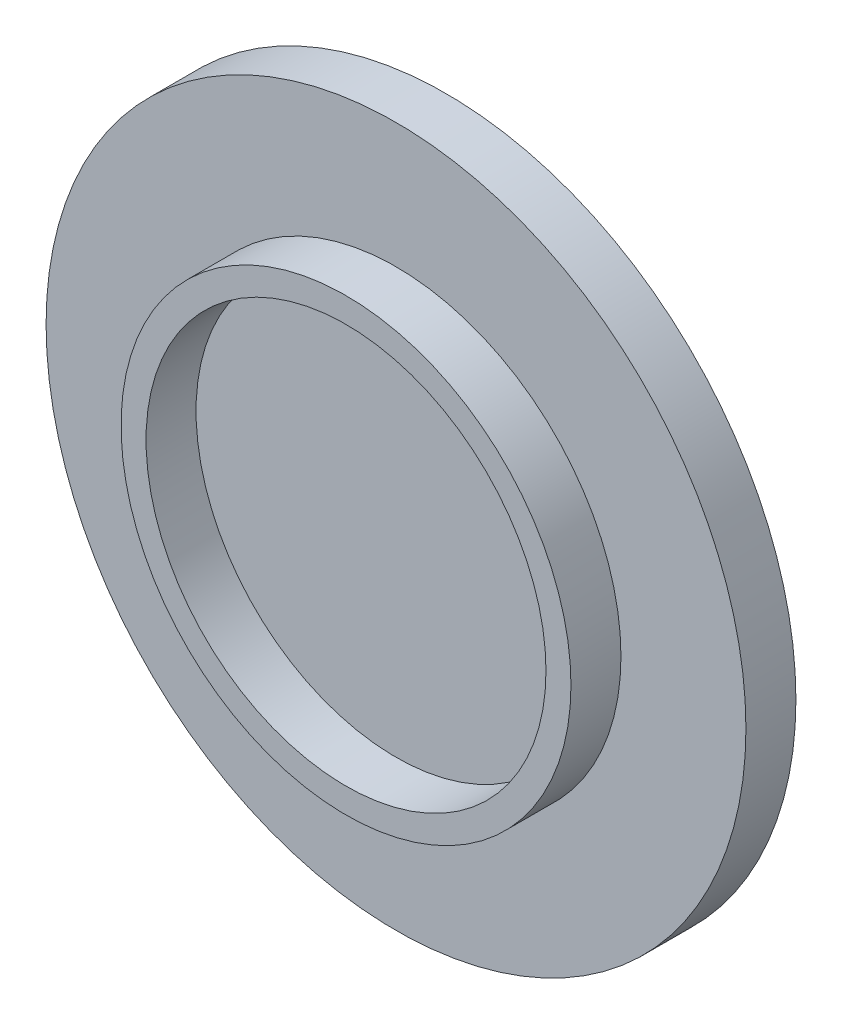
ISO-10303-21;
HEADER;
FILE_DESCRIPTION(('STEP AP214'),'2;1');
FILE_NAME('part.step','',(''),(''),'','','');
FILE_SCHEMA(('AUTOMOTIVE_DESIGN { 1 0 10303 214 1 1 1 1 }'));
ENDSEC;
DATA;
#1=APPLICATION_CONTEXT('core data for automotive mechanical design processes');
#2=APPLICATION_PROTOCOL_DEFINITION('international standard','automotive_design',2000,#1);
#3=PRODUCT_CONTEXT('',#1,'mechanical');
#4=PRODUCT('Part','Part','',(#3));
#5=PRODUCT_RELATED_PRODUCT_CATEGORY('part','',(#4));
#6=PRODUCT_DEFINITION_FORMATION('','',#4);
#7=PRODUCT_DEFINITION_CONTEXT('part definition',#1,'design');
#8=PRODUCT_DEFINITION('design','',#6,#7);
#9=PRODUCT_DEFINITION_SHAPE('','',#8);
#10=(LENGTH_UNIT() NAMED_UNIT(*) SI_UNIT(.MILLI.,.METRE.));
#11=(NAMED_UNIT(*) PLANE_ANGLE_UNIT() SI_UNIT($,.RADIAN.));
#12=(NAMED_UNIT(*) SI_UNIT($,.STERADIAN.) SOLID_ANGLE_UNIT());
#13=UNCERTAINTY_MEASURE_WITH_UNIT(LENGTH_MEASURE(1.E-05),#10,'distance_accuracy_value','');
#14=(GEOMETRIC_REPRESENTATION_CONTEXT(3) GLOBAL_UNCERTAINTY_ASSIGNED_CONTEXT((#13)) GLOBAL_UNIT_ASSIGNED_CONTEXT((#10,
#11,#12)) REPRESENTATION_CONTEXT('',''));
#15=CARTESIAN_POINT('',(0.,0.,0.));
#16=DIRECTION('',(0.,0.,1.));
#17=DIRECTION('',(1.,0.,0.));
#18=AXIS2_PLACEMENT_3D('',#15,#16,#17);
#19=CARTESIAN_POINT('',(0.,0.,10.));
#20=DIRECTION('',(0.,0.,-1.));
#21=DIRECTION('',(-1.,0.,0.));
#22=AXIS2_PLACEMENT_3D('',#19,#20,#21);
#23=CYLINDRICAL_SURFACE('',#22,70.);
#24=CARTESIAN_POINT('',(0.,0.,10.));
#25=DIRECTION('',(0.,0.,1.));
#26=DIRECTION('',(1.,0.,0.));
#27=AXIS2_PLACEMENT_3D('',#24,#25,#26);
#28=CIRCLE('',#27,70.);
#29=CARTESIAN_POINT('',(70.,0.,10.));
#30=VERTEX_POINT('',#29);
#31=EDGE_CURVE('E38',#30,#30,#28,.T.);
#32=ORIENTED_EDGE('',*,*,#31,.F.);
#33=EDGE_LOOP('',(#32));
#34=FACE_BOUND('',#33,.T.);
#35=CARTESIAN_POINT('',(0.,0.,0.));
#36=DIRECTION('',(0.,0.,1.));
#37=DIRECTION('',(1.,0.,0.));
#38=AXIS2_PLACEMENT_3D('',#35,#36,#37);
#39=CIRCLE('',#38,70.);
#40=CARTESIAN_POINT('',(70.,0.,0.));
#41=VERTEX_POINT('',#40);
#42=EDGE_CURVE('E34',#41,#41,#39,.T.);
#43=ORIENTED_EDGE('',*,*,#42,.T.);
#44=EDGE_LOOP('',(#43));
#45=FACE_BOUND('',#44,.T.);
#46=ADVANCED_FACE('F31',(#34,#45),#23,.T.);
#47=CARTESIAN_POINT('',(0.,0.,10.));
#48=DIRECTION('',(0.,0.,1.));
#49=DIRECTION('',(1.,0.,0.));
#50=AXIS2_PLACEMENT_3D('',#47,#48,#49);
#51=PLANE('',#50);
#52=CARTESIAN_POINT('',(0.,0.,10.));
#53=DIRECTION('',(0.,0.,1.));
#54=DIRECTION('',(1.,0.,0.));
#55=AXIS2_PLACEMENT_3D('',#52,#53,#54);
#56=CIRCLE('',#55,45.);
#57=CARTESIAN_POINT('',(45.,0.,10.));
#58=VERTEX_POINT('',#57);
#59=EDGE_CURVE('E10',#58,#58,#56,.T.);
#60=ORIENTED_EDGE('',*,*,#59,.F.);
#61=EDGE_LOOP('',(#60));
#62=FACE_BOUND('',#61,.T.);
#63=ORIENTED_EDGE('',*,*,#31,.T.);
#64=EDGE_LOOP('',(#63));
#65=FACE_BOUND('',#64,.T.);
#66=ADVANCED_FACE('F75',(#62,#65),#51,.T.);
#67=CARTESIAN_POINT('',(0.,0.,0.));
#68=DIRECTION('',(0.,0.,1.));
#69=DIRECTION('',(1.,0.,0.));
#70=AXIS2_PLACEMENT_3D('',#67,#68,#69);
#71=PLANE('',#70);
#72=ORIENTED_EDGE('',*,*,#42,.F.);
#73=EDGE_LOOP('',(#72));
#74=FACE_BOUND('',#73,.T.);
#75=ADVANCED_FACE('F70',(#74),#71,.F.);
#76=CARTESIAN_POINT('',(0.,0.,20.));
#77=DIRECTION('',(0.,0.,-1.));
#78=DIRECTION('',(-1.,0.,0.));
#79=AXIS2_PLACEMENT_3D('',#76,#77,#78);
#80=CYLINDRICAL_SURFACE('',#79,45.);
#81=CARTESIAN_POINT('',(0.,0.,20.));
#82=DIRECTION('',(0.,0.,1.));
#83=DIRECTION('',(1.,0.,0.));
#84=AXIS2_PLACEMENT_3D('',#81,#82,#83);
#85=CIRCLE('',#84,45.);
#86=CARTESIAN_POINT('',(45.,0.,20.));
#87=VERTEX_POINT('',#86);
#88=EDGE_CURVE('E44',#87,#87,#85,.T.);
#89=ORIENTED_EDGE('',*,*,#88,.F.);
#90=EDGE_LOOP('',(#89));
#91=FACE_BOUND('',#90,.T.);
#92=ORIENTED_EDGE('',*,*,#59,.T.);
#93=EDGE_LOOP('',(#92));
#94=FACE_BOUND('',#93,.T.);
#95=ADVANCED_FACE('F65',(#91,#94),#80,.T.);
#96=CARTESIAN_POINT('',(0.,0.,20.));
#97=DIRECTION('',(0.,0.,1.));
#98=DIRECTION('',(1.,0.,0.));
#99=AXIS2_PLACEMENT_3D('',#96,#97,#98);
#100=PLANE('',#99);
#101=CARTESIAN_POINT('',(0.,0.,20.));
#102=DIRECTION('',(0.,0.,1.));
#103=DIRECTION('',(1.,0.,0.));
#104=AXIS2_PLACEMENT_3D('',#101,#102,#103);
#105=CIRCLE('',#104,40.);
#106=CARTESIAN_POINT('',(40.,0.,20.));
#107=VERTEX_POINT('',#106);
#108=EDGE_CURVE('E48',#107,#107,#105,.T.);
#109=ORIENTED_EDGE('',*,*,#108,.F.);
#110=EDGE_LOOP('',(#109));
#111=FACE_BOUND('',#110,.T.);
#112=ORIENTED_EDGE('',*,*,#88,.T.);
#113=EDGE_LOOP('',(#112));
#114=FACE_BOUND('',#113,.T.);
#115=ADVANCED_FACE('F59',(#111,#114),#100,.T.);
#116=CARTESIAN_POINT('',(0.,0.,10.));
#117=DIRECTION('',(0.,0.,1.));
#118=DIRECTION('',(1.,0.,0.));
#119=AXIS2_PLACEMENT_3D('',#116,#117,#118);
#120=CYLINDRICAL_SURFACE('',#119,40.);
#121=CARTESIAN_POINT('',(0.,0.,10.));
#122=DIRECTION('',(0.,0.,1.));
#123=DIRECTION('',(1.,0.,0.));
#124=AXIS2_PLACEMENT_3D('',#121,#122,#123);
#125=CIRCLE('',#124,40.);
#126=CARTESIAN_POINT('',(40.,0.,10.));
#127=VERTEX_POINT('',#126);
#128=EDGE_CURVE('E47',#127,#127,#125,.T.);
#129=ORIENTED_EDGE('',*,*,#128,.F.);
#130=EDGE_LOOP('',(#129));
#131=FACE_BOUND('',#130,.T.);
#132=ORIENTED_EDGE('',*,*,#108,.T.);
#133=EDGE_LOOP('',(#132));
#134=FACE_BOUND('',#133,.T.);
#135=ADVANCED_FACE('F56',(#131,#134),#120,.F.);
#136=CARTESIAN_POINT('',(0.,0.,10.));
#137=DIRECTION('',(0.,0.,1.));
#138=DIRECTION('',(1.,0.,0.));
#139=AXIS2_PLACEMENT_3D('',#136,#137,#138);
#140=PLANE('',#139);
#141=ORIENTED_EDGE('',*,*,#128,.T.);
#142=EDGE_LOOP('',(#141));
#143=FACE_BOUND('',#142,.T.);
#144=ADVANCED_FACE('F54',(#143),#140,.T.);
#145=CLOSED_SHELL('',(#46,#66,#75,#95,#115,#135,#144));
#146=MANIFOLD_SOLID_BREP('B2',#145);
#147=ADVANCED_BREP_SHAPE_REPRESENTATION('',(#18,#146),#14);
#148=SHAPE_DEFINITION_REPRESENTATION(#9,#147);
ENDSEC;
END-ISO-10303-21;
